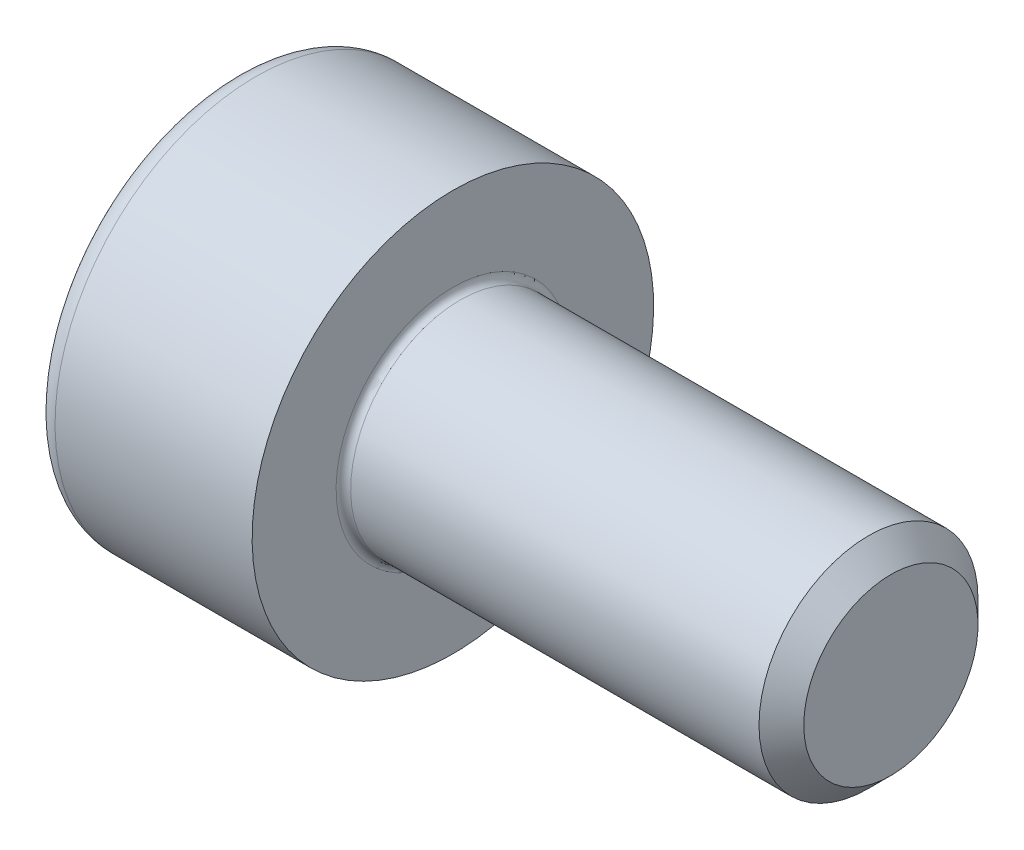
ISO-10303-21;
HEADER;
FILE_DESCRIPTION(('STEP AP214'),'2;1');
FILE_NAME('part.step','',(''),(''),'','','');
FILE_SCHEMA(('AUTOMOTIVE_DESIGN { 1 0 10303 214 1 1 1 1 }'));
ENDSEC;
DATA;
#1=APPLICATION_CONTEXT('core data for automotive mechanical design processes');
#2=APPLICATION_PROTOCOL_DEFINITION('international standard','automotive_design',2000,#1);
#3=PRODUCT_CONTEXT('',#1,'mechanical');
#4=PRODUCT('Part','Part','',(#3));
#5=PRODUCT_RELATED_PRODUCT_CATEGORY('part','',(#4));
#6=PRODUCT_DEFINITION_FORMATION('','',#4);
#7=PRODUCT_DEFINITION_CONTEXT('part definition',#1,'design');
#8=PRODUCT_DEFINITION('design','',#6,#7);
#9=PRODUCT_DEFINITION_SHAPE('','',#8);
#10=(LENGTH_UNIT() NAMED_UNIT(*) SI_UNIT(.MILLI.,.METRE.));
#11=(NAMED_UNIT(*) PLANE_ANGLE_UNIT() SI_UNIT($,.RADIAN.));
#12=(NAMED_UNIT(*) SI_UNIT($,.STERADIAN.) SOLID_ANGLE_UNIT());
#13=UNCERTAINTY_MEASURE_WITH_UNIT(LENGTH_MEASURE(1.E-05),#10,'distance_accuracy_value','');
#14=(GEOMETRIC_REPRESENTATION_CONTEXT(3) GLOBAL_UNCERTAINTY_ASSIGNED_CONTEXT((#13)) GLOBAL_UNIT_ASSIGNED_CONTEXT((#10,
#11,#12)) REPRESENTATION_CONTEXT('',''));
#15=CARTESIAN_POINT('',(0.,0.,0.));
#16=DIRECTION('',(0.,0.,1.));
#17=DIRECTION('',(1.,0.,0.));
#18=AXIS2_PLACEMENT_3D('',#15,#16,#17);
#19=CARTESIAN_POINT('',(-1.50499999995191,0.,0.));
#20=DIRECTION('',(-1.,0.,0.));
#21=DIRECTION('',(0.,0.,1.));
#22=AXIS2_PLACEMENT_3D('',#19,#20,#21);
#23=CONICAL_SURFACE('',#22,1.45203592694543,1.04719755110347);
#24=CARTESIAN_POINT('',(-0.666666666631954,-5.6843418860808E-11,0.));
#25=VERTEX_POINT('',#24);
#26=VERTEX_LOOP('',#25);
#27=FACE_BOUND('',#26,.T.);
#28=CARTESIAN_POINT('',(-1.49999999999004,1.25,0.721687836489904));
#29=CARTESIAN_POINT('',(-1.48168471568985,1.25,0.658260217059864));
#30=CARTESIAN_POINT('',(-1.46502792316932,1.25,0.594285091321007));
#31=CARTESIAN_POINT('',(-1.43595399209987,1.25,0.465227153334786));
#32=CARTESIAN_POINT('',(-1.42354713768306,1.25,0.40014204872408));
#33=CARTESIAN_POINT('',(-1.40423497430876,1.25,0.270778406577995));
#34=CARTESIAN_POINT('',(-1.3972011172141,1.25,0.206519767721449));
#35=CARTESIAN_POINT('',(-1.38880573004626,1.25,0.0777002896277506));
#36=CARTESIAN_POINT('',(-1.38743724619873,1.25,0.0131399182931016));
#37=CARTESIAN_POINT('',(-1.39029143131319,1.25,-0.107484209673351));
#38=CARTESIAN_POINT('',(-1.39381330322771,1.25,-0.163566066938274));
#39=CARTESIAN_POINT('',(-1.40497331291925,1.25,-0.275364426461426));
#40=CARTESIAN_POINT('',(-1.41261525920259,1.25,-0.331080542327595));
#41=CARTESIAN_POINT('',(-1.4317186458128,1.25,-0.443109217014839));
#42=CARTESIAN_POINT('',(-1.44326102636524,1.25,-0.49940760424794));
#43=CARTESIAN_POINT('',(-1.46945735050873,1.25,-0.611164931126897));
#44=CARTESIAN_POINT('',(-1.48410514295715,1.25,-0.666625301408834));
#45=CARTESIAN_POINT('',(-1.49999999999004,1.25,-0.721687836489906));
#46=B_SPLINE_CURVE_WITH_KNOTS('',3,(#28,#29,#30,#31,#32,#33,#34,#35,#36,#37,#38,#39,#40,#41,#42,
#43,#44,#45),.UNSPECIFIED.,.F.,.F.,(4,2,2,2,2,2,2,2,4),(0.,0.198135007230315,0.396746135656778,
0.590442253865621,0.783900555586254,0.952317364166839,1.12089012114027,1.2932010140725,
1.46517373346208),.UNSPECIFIED.);
#47=CARTESIAN_POINT('',(-1.49999999999004,1.25000000000124,0.721687836487751));
#48=VERTEX_POINT('',#47);
#49=CARTESIAN_POINT('',(-1.49999999998963,1.25,-0.721687836488469));
#50=VERTEX_POINT('',#49);
#51=EDGE_CURVE('E20',#48,#50,#46,.T.);
#52=ORIENTED_EDGE('',*,*,#51,.T.);
#53=CARTESIAN_POINT('',(-1.49999999999004,1.25000000000249,-0.721687836485598));
#54=CARTESIAN_POINT('',(-1.48168471568985,1.1950700702745,-0.753401646200618));
#55=CARTESIAN_POINT('',(-1.46502792316932,1.13966598617435,-0.785389209070046));
#56=CARTESIAN_POINT('',(-1.43595399209987,1.02789853331824,-0.849918178063157));
#57=CARTESIAN_POINT('',(-1.42354713768306,0.971533179317402,-0.88246073036851));
#58=CARTESIAN_POINT('',(-1.40423497430876,0.859500978892814,-0.947142551441552));
#59=CARTESIAN_POINT('',(-1.3972011172141,0.803851365230434,-0.979271870869826));
#60=CARTESIAN_POINT('',(-1.38880573004627,0.692290424699039,-1.04368160991667));
#61=CARTESIAN_POINT('',(-1.38743724619873,0.636379503045476,-1.075961795584));
#62=CARTESIAN_POINT('',(-1.3902914313132,0.531915943917184,-1.13627385956723));
#63=CARTESIAN_POINT('',(-1.39381330322771,0.483347630834348,-1.16431478819969));
#64=CARTESIAN_POINT('',(-1.40497331291925,0.386527411385872,-1.22021396796126));
#65=CARTESIAN_POINT('',(-1.41261525920259,0.338275839645572,-1.24807202589435));
#66=CARTESIAN_POINT('',(-1.4317186458128,0.241256161414116,-1.30408636323797));
#67=CARTESIAN_POINT('',(-1.44326102636524,0.192500327878158,-1.33223555685452));
#68=CARTESIAN_POINT('',(-1.46945735050873,0.0957156437419392,-1.388114220294));
#69=CARTESIAN_POINT('',(-1.48410514295715,0.0476855541744902,-1.41584440543497));
#70=CARTESIAN_POINT('',(-1.49999999999004,-2.48950866463537E-12,-1.4433756729755));
#71=B_SPLINE_CURVE_WITH_KNOTS('',3,(#53,#54,#55,#56,#57,#58,#59,#60,#61,#62,#63,#64,#65,#66,#67,
#68,#69,#70),.UNSPECIFIED.,.F.,.F.,(4,2,2,2,2,2,2,2,4),(0.,0.198135007230316,0.396746135656778,
0.590442253865621,0.783900555586254,0.952317364166839,1.12089012114027,1.2932010140725,
1.46517373346208),.UNSPECIFIED.);
#72=CARTESIAN_POINT('',(-1.49999999999004,0.,-1.4433756729755));
#73=VERTEX_POINT('',#72);
#74=EDGE_CURVE('E81',#50,#73,#71,.T.);
#75=ORIENTED_EDGE('',*,*,#74,.T.);
#76=CARTESIAN_POINT('',(-1.49999999999004,2.48350391731348E-12,-1.4433756729755));
#77=CARTESIAN_POINT('',(-1.48168471568985,-0.0549299297255024,-1.41166186326048));
#78=CARTESIAN_POINT('',(-1.46502792316932,-0.110334013825656,-1.37967430039106));
#79=CARTESIAN_POINT('',(-1.43595399209988,-0.222101466681762,-1.31514533139794));
#80=CARTESIAN_POINT('',(-1.42354713768306,-0.2784668206826,-1.28260277909259));
#81=CARTESIAN_POINT('',(-1.40423497430876,-0.390499021107189,-1.21792095801955));
#82=CARTESIAN_POINT('',(-1.39720111721411,-0.446148634769569,-1.18579163859128));
#83=CARTESIAN_POINT('',(-1.38880573004627,-0.557709575300964,-1.12138189954443));
#84=CARTESIAN_POINT('',(-1.38743724619873,-0.613620496954527,-1.0891017138771));
#85=CARTESIAN_POINT('',(-1.3902914313132,-0.71808405608282,-1.02878964989388));
#86=CARTESIAN_POINT('',(-1.39381330322771,-0.766652369165656,-1.00074872126142));
#87=CARTESIAN_POINT('',(-1.40497331291926,-0.86347258861413,-0.94484954149984));
#88=CARTESIAN_POINT('',(-1.41261525920259,-0.91172416035443,-0.916991483566755));
#89=CARTESIAN_POINT('',(-1.43171864581281,-1.00874383858588,-0.860977146223133));
#90=CARTESIAN_POINT('',(-1.44326102636524,-1.05749967212184,-0.832827952606583));
#91=CARTESIAN_POINT('',(-1.46945735050874,-1.15428435625806,-0.776949289167105));
#92=CARTESIAN_POINT('',(-1.48410514295715,-1.20231444582551,-0.749219104026137));
#93=CARTESIAN_POINT('',(-1.49999999999005,-1.25000000000249,-0.721687836485601));
#94=B_SPLINE_CURVE_WITH_KNOTS('',3,(#76,#77,#78,#79,#80,#81,#82,#83,#84,#85,#86,#87,#88,#89,#90,
#91,#92,#93),.UNSPECIFIED.,.F.,.F.,(4,2,2,2,2,2,2,2,4),(0.,0.198135007230316,0.396746135656779,
0.590442253865623,0.783900555586256,0.95231736416684,1.12089012114027,1.2932010140725,
1.46517373346208),.UNSPECIFIED.);
#95=CARTESIAN_POINT('',(-1.49999999999004,-1.25000000000124,-0.721687836487754));
#96=VERTEX_POINT('',#95);
#97=EDGE_CURVE('E112',#73,#96,#94,.T.);
#98=ORIENTED_EDGE('',*,*,#97,.T.);
#99=CARTESIAN_POINT('',(-1.49999999999004,-1.25,-0.721687836489906));
#100=CARTESIAN_POINT('',(-1.48168471568985,-1.25,-0.658260217059866));
#101=CARTESIAN_POINT('',(-1.46502792316932,-1.25,-0.594285091321009));
#102=CARTESIAN_POINT('',(-1.43595399209987,-1.25,-0.465227153334788));
#103=CARTESIAN_POINT('',(-1.42354713768306,-1.25,-0.400142048724082));
#104=CARTESIAN_POINT('',(-1.40423497430876,-1.25,-0.270778406577997));
#105=CARTESIAN_POINT('',(-1.3972011172141,-1.25,-0.206519767721451));
#106=CARTESIAN_POINT('',(-1.38880573004627,-1.25,-0.0777002896277524));
#107=CARTESIAN_POINT('',(-1.38743724619873,-1.25,-0.0131399182931034));
#108=CARTESIAN_POINT('',(-1.39029143131319,-1.25,0.107484209673349));
#109=CARTESIAN_POINT('',(-1.39381330322771,-1.25,0.163566066938272));
#110=CARTESIAN_POINT('',(-1.40497331291925,-1.25,0.275364426461424));
#111=CARTESIAN_POINT('',(-1.41261525920259,-1.25,0.331080542327594));
#112=CARTESIAN_POINT('',(-1.4317186458128,-1.25,0.443109217014838));
#113=CARTESIAN_POINT('',(-1.44326102636524,-1.25,0.499407604247938));
#114=CARTESIAN_POINT('',(-1.46945735050873,-1.25,0.611164931126896));
#115=CARTESIAN_POINT('',(-1.48410514295715,-1.25,0.666625301408833));
#116=CARTESIAN_POINT('',(-1.49999999999004,-1.25,0.721687836489905));
#117=B_SPLINE_CURVE_WITH_KNOTS('',3,(#99,#100,#101,#102,#103,#104,#105,#106,#107,#108,#109,#110,
#111,#112,#113,#114,#115,#116),.UNSPECIFIED.,.F.,.F.,(4,2,2,2,2,2,2,2,4),(0.,0.198135007230316,
0.396746135656778,0.590442253865622,0.783900555586254,0.95231736416684,1.12089012114027,
1.2932010140725,1.46517373346208),.UNSPECIFIED.);
#118=CARTESIAN_POINT('',(-1.49999999999004,-1.25000000000124,0.721687836487751));
#119=VERTEX_POINT('',#118);
#120=EDGE_CURVE('E136',#96,#119,#117,.T.);
#121=ORIENTED_EDGE('',*,*,#120,.T.);
#122=CARTESIAN_POINT('',(-1.49999999999004,-1.25000000000249,0.721687836485597));
#123=CARTESIAN_POINT('',(-1.48168471568985,-1.1950700702745,0.753401646200617));
#124=CARTESIAN_POINT('',(-1.46502792316932,-1.13966598617435,0.785389209070046));
#125=CARTESIAN_POINT('',(-1.43595399209987,-1.02789853331824,0.849918178063156));
#126=CARTESIAN_POINT('',(-1.42354713768306,-0.971533179317404,0.882460730368509));
#127=CARTESIAN_POINT('',(-1.40423497430876,-0.859500978892815,0.947142551441551));
#128=CARTESIAN_POINT('',(-1.3972011172141,-0.803851365230436,0.979271870869825));
#129=CARTESIAN_POINT('',(-1.38880573004627,-0.69229042469904,1.04368160991667));
#130=CARTESIAN_POINT('',(-1.38743724619873,-0.636379503045478,1.075961795584));
#131=CARTESIAN_POINT('',(-1.39029143131319,-0.531915943917185,1.13627385956722));
#132=CARTESIAN_POINT('',(-1.39381330322771,-0.483347630834349,1.16431478819969));
#133=CARTESIAN_POINT('',(-1.40497331291925,-0.386527411385873,1.22021396796126));
#134=CARTESIAN_POINT('',(-1.41261525920259,-0.338275839645574,1.24807202589435));
#135=CARTESIAN_POINT('',(-1.4317186458128,-0.241256161414118,1.30408636323797));
#136=CARTESIAN_POINT('',(-1.44326102636524,-0.192500327878159,1.33223555685452));
#137=CARTESIAN_POINT('',(-1.46945735050873,-0.0957156437419403,1.388114220294));
#138=CARTESIAN_POINT('',(-1.48410514295715,-0.0476855541744914,1.41584440543497));
#139=CARTESIAN_POINT('',(-1.49999999999004,2.48814392209341E-12,1.4433756729755));
#140=B_SPLINE_CURVE_WITH_KNOTS('',3,(#122,#123,#124,#125,#126,#127,#128,#129,#130,#131,#132,
#133,#134,#135,#136,#137,#138,#139),.UNSPECIFIED.,.F.,.F.,(4,2,2,2,2,2,2,2,4),(0.,
0.198135007230316,0.396746135656778,0.590442253865622,0.783900555586254,0.95231736416684,
1.12089012114027,1.2932010140725,1.46517373346208),.UNSPECIFIED.);
#141=CARTESIAN_POINT('',(-1.49999999999004,0.,1.4433756729755));
#142=VERTEX_POINT('',#141);
#143=EDGE_CURVE('E145',#119,#142,#140,.T.);
#144=ORIENTED_EDGE('',*,*,#143,.T.);
#145=CARTESIAN_POINT('',(-1.49999999999005,-2.48476584893157E-12,1.4433756729755));
#146=CARTESIAN_POINT('',(-1.48168471568985,0.0549299297255009,1.41166186326048));
#147=CARTESIAN_POINT('',(-1.46502792316932,0.110334013825655,1.37967430039106));
#148=CARTESIAN_POINT('',(-1.43595399209988,0.22210146668176,1.31514533139794));
#149=CARTESIAN_POINT('',(-1.42354713768306,0.278466820682599,1.28260277909259));
#150=CARTESIAN_POINT('',(-1.40423497430876,0.390499021107188,1.21792095801955));
#151=CARTESIAN_POINT('',(-1.39720111721411,0.446148634769567,1.18579163859128));
#152=CARTESIAN_POINT('',(-1.38880573004627,0.557709575300963,1.12138189954443));
#153=CARTESIAN_POINT('',(-1.38743724619873,0.613620496954526,1.0891017138771));
#154=CARTESIAN_POINT('',(-1.3902914313132,0.718084056082818,1.02878964989388));
#155=CARTESIAN_POINT('',(-1.39381330322771,0.766652369165654,1.00074872126141));
#156=CARTESIAN_POINT('',(-1.40497331291926,0.863472588614129,0.944849541499838));
#157=CARTESIAN_POINT('',(-1.41261525920259,0.911724160354429,0.916991483566754));
#158=CARTESIAN_POINT('',(-1.4317186458128,1.00874383858588,0.860977146223132));
#159=CARTESIAN_POINT('',(-1.44326102636524,1.05749967212184,0.832827952606581));
#160=CARTESIAN_POINT('',(-1.46945735050874,1.15428435625806,0.776949289167103));
#161=CARTESIAN_POINT('',(-1.48410514295715,1.20231444582551,0.749219104026134));
#162=CARTESIAN_POINT('',(-1.49999999999004,1.25000000000249,0.721687836485599));
#163=B_SPLINE_CURVE_WITH_KNOTS('',3,(#145,#146,#147,#148,#149,#150,#151,#152,#153,#154,#155,
#156,#157,#158,#159,#160,#161,#162),.UNSPECIFIED.,.F.,.F.,(4,2,2,2,2,2,2,2,4),(0.,
0.198135007230316,0.396746135656779,0.590442253865623,0.783900555586256,0.952317364166841,
1.12089012114027,1.2932010140725,1.46517373346208),.UNSPECIFIED.);
#164=EDGE_CURVE('E83',#142,#48,#163,.T.);
#165=ORIENTED_EDGE('',*,*,#164,.T.);
#166=EDGE_LOOP('',(#52,#75,#98,#121,#144,#165));
#167=FACE_BOUND('',#166,.T.);
#168=ADVANCED_FACE('F16',(#27,#167),#23,.F.);
#169=CARTESIAN_POINT('',(-2.99999999999999,1.25,0.721687836487031));
#170=DIRECTION('',(0.,1.,0.));
#171=DIRECTION('',(0.,0.,1.));
#172=AXIS2_PLACEMENT_3D('',#169,#170,#171);
#173=PLANE('',#172);
#174=DIRECTION('',(1.,0.,0.));
#175=VECTOR('',#174,1.);
#176=CARTESIAN_POINT('',(-2.99999999999999,1.25,0.721687836487034));
#177=LINE('',#176,#175);
#178=CARTESIAN_POINT('',(-2.99999999999999,1.25,0.721687836487032));
#179=VERTEX_POINT('',#178);
#180=EDGE_CURVE('E86',#48,#179,#177,.F.);
#181=ORIENTED_EDGE('',*,*,#180,.T.);
#182=DIRECTION('',(0.,0.,1.));
#183=VECTOR('',#182,1.);
#184=CARTESIAN_POINT('',(-2.99999999999999,1.25,0.));
#185=LINE('',#184,#183);
#186=CARTESIAN_POINT('',(-2.99999999999999,1.25,-0.721687836487033));
#187=VERTEX_POINT('',#186);
#188=EDGE_CURVE('E91',#187,#179,#185,.T.);
#189=ORIENTED_EDGE('',*,*,#188,.F.);
#190=DIRECTION('',(1.,0.,0.));
#191=VECTOR('',#190,1.);
#192=CARTESIAN_POINT('',(-2.99999999999999,1.25,-0.721687836487033));
#193=LINE('',#192,#191);
#194=EDGE_CURVE('E89',#187,#50,#193,.T.);
#195=ORIENTED_EDGE('',*,*,#194,.T.);
#196=ORIENTED_EDGE('',*,*,#51,.F.);
#197=EDGE_LOOP('',(#181,#189,#195,#196));
#198=FACE_BOUND('',#197,.T.);
#199=ADVANCED_FACE('F77',(#198),#173,.F.);
#200=CARTESIAN_POINT('',(-2.99999999999999,0.,1.44337567297407));
#201=DIRECTION('',(0.,0.500000000000001,0.866025403784438));
#202=DIRECTION('',(0.,-0.866025403784438,0.500000000000001));
#203=AXIS2_PLACEMENT_3D('',#200,#201,#202);
#204=PLANE('',#203);
#205=DIRECTION('',(1.,0.,0.));
#206=VECTOR('',#205,1.);
#207=CARTESIAN_POINT('',(-2.99999999999999,0.,1.44337567297407));
#208=LINE('',#207,#206);
#209=CARTESIAN_POINT('',(-2.99999999999999,0.,1.44337567297407));
#210=VERTEX_POINT('',#209);
#211=EDGE_CURVE('E150',#142,#210,#208,.F.);
#212=ORIENTED_EDGE('',*,*,#211,.T.);
#213=DIRECTION('',(0.,-0.866025403784437,0.500000000000004));
#214=VECTOR('',#213,1.);
#215=CARTESIAN_POINT('',(-2.99999999999999,1.25,0.721687836487031));
#216=LINE('',#215,#214);
#217=EDGE_CURVE('E102',#179,#210,#216,.T.);
#218=ORIENTED_EDGE('',*,*,#217,.F.);
#219=ORIENTED_EDGE('',*,*,#180,.F.);
#220=ORIENTED_EDGE('',*,*,#164,.F.);
#221=EDGE_LOOP('',(#212,#218,#219,#220));
#222=FACE_BOUND('',#221,.T.);
#223=ADVANCED_FACE('F155',(#222),#204,.F.);
#224=CARTESIAN_POINT('',(-2.99999999999999,-1.25,0.721687836487033));
#225=DIRECTION('',(0.,-0.5,0.866025403784439));
#226=DIRECTION('',(0.,-0.866025403784439,-0.5));
#227=AXIS2_PLACEMENT_3D('',#224,#225,#226);
#228=PLANE('',#227);
#229=DIRECTION('',(1.,0.,0.));
#230=VECTOR('',#229,1.);
#231=CARTESIAN_POINT('',(-2.99999999999999,-1.25,0.721687836487033));
#232=LINE('',#231,#230);
#233=CARTESIAN_POINT('',(-2.99999999999999,-1.25,0.721687836487033));
#234=VERTEX_POINT('',#233);
#235=EDGE_CURVE('E144',#119,#234,#232,.F.);
#236=ORIENTED_EDGE('',*,*,#235,.T.);
#237=DIRECTION('',(0.,-0.866025403784437,-0.500000000000003));
#238=VECTOR('',#237,1.);
#239=CARTESIAN_POINT('',(-2.99999999999999,0.,1.44337567297407));
#240=LINE('',#239,#238);
#241=EDGE_CURVE('E282',#210,#234,#240,.T.);
#242=ORIENTED_EDGE('',*,*,#241,.F.);
#243=ORIENTED_EDGE('',*,*,#211,.F.);
#244=ORIENTED_EDGE('',*,*,#143,.F.);
#245=EDGE_LOOP('',(#236,#242,#243,#244));
#246=FACE_BOUND('',#245,.T.);
#247=ADVANCED_FACE('F132',(#246),#228,.F.);
#248=CARTESIAN_POINT('',(-2.99999999999999,-1.25,-0.721687836487032));
#249=DIRECTION('',(0.,-1.,0.));
#250=DIRECTION('',(1.,0.,0.));
#251=AXIS2_PLACEMENT_3D('',#248,#249,#250);
#252=PLANE('',#251);
#253=DIRECTION('',(1.,0.,0.));
#254=VECTOR('',#253,1.);
#255=CARTESIAN_POINT('',(-2.99999999999999,-1.25,-0.721687836487037));
#256=LINE('',#255,#254);
#257=CARTESIAN_POINT('',(-2.99999999999999,-1.25,-0.721687836487034));
#258=VERTEX_POINT('',#257);
#259=EDGE_CURVE('E143',#96,#258,#256,.F.);
#260=ORIENTED_EDGE('',*,*,#259,.T.);
#261=DIRECTION('',(0.,0.,1.));
#262=VECTOR('',#261,1.);
#263=CARTESIAN_POINT('',(-2.99999999999999,-1.25,0.));
#264=LINE('',#263,#262);
#265=EDGE_CURVE('E276',#234,#258,#264,.F.);
#266=ORIENTED_EDGE('',*,*,#265,.F.);
#267=ORIENTED_EDGE('',*,*,#235,.F.);
#268=ORIENTED_EDGE('',*,*,#120,.F.);
#269=EDGE_LOOP('',(#260,#266,#267,#268));
#270=FACE_BOUND('',#269,.T.);
#271=ADVANCED_FACE('F128',(#270),#252,.F.);
#272=CARTESIAN_POINT('',(-2.99999999999999,0.,-1.44337567297407));
#273=DIRECTION('',(0.,-0.5,-0.866025403784439));
#274=DIRECTION('',(0.,0.866025403784439,-0.5));
#275=AXIS2_PLACEMENT_3D('',#272,#273,#274);
#276=PLANE('',#275);
#277=DIRECTION('',(1.,0.,0.));
#278=VECTOR('',#277,1.);
#279=CARTESIAN_POINT('',(-2.99999999999999,0.,-1.44337567297407));
#280=LINE('',#279,#278);
#281=CARTESIAN_POINT('',(-2.99999999999999,0.,-1.44337567297407));
#282=VERTEX_POINT('',#281);
#283=EDGE_CURVE('E39',#73,#282,#280,.F.);
#284=ORIENTED_EDGE('',*,*,#283,.T.);
#285=DIRECTION('',(0.,0.866025403784437,-0.500000000000003));
#286=VECTOR('',#285,1.);
#287=CARTESIAN_POINT('',(-2.99999999999999,-1.25,-0.721687836487032));
#288=LINE('',#287,#286);
#289=EDGE_CURVE('E270',#258,#282,#288,.T.);
#290=ORIENTED_EDGE('',*,*,#289,.F.);
#291=ORIENTED_EDGE('',*,*,#259,.F.);
#292=ORIENTED_EDGE('',*,*,#97,.F.);
#293=EDGE_LOOP('',(#284,#290,#291,#292));
#294=FACE_BOUND('',#293,.T.);
#295=ADVANCED_FACE('F122',(#294),#276,.F.);
#296=CARTESIAN_POINT('',(-2.99999999999999,1.25,-0.721687836487033));
#297=DIRECTION('',(0.,0.5,-0.866025403784439));
#298=DIRECTION('',(0.,0.866025403784439,0.5));
#299=AXIS2_PLACEMENT_3D('',#296,#297,#298);
#300=PLANE('',#299);
#301=ORIENTED_EDGE('',*,*,#194,.F.);
#302=DIRECTION('',(0.,0.866025403784437,0.500000000000002));
#303=VECTOR('',#302,1.);
#304=CARTESIAN_POINT('',(-2.99999999999999,0.,-1.44337567297407));
#305=LINE('',#304,#303);
#306=EDGE_CURVE('E267',#282,#187,#305,.T.);
#307=ORIENTED_EDGE('',*,*,#306,.F.);
#308=ORIENTED_EDGE('',*,*,#283,.F.);
#309=ORIENTED_EDGE('',*,*,#74,.F.);
#310=EDGE_LOOP('',(#301,#307,#308,#309));
#311=FACE_BOUND('',#310,.T.);
#312=ADVANCED_FACE('F96',(#311),#300,.F.);
#313=CARTESIAN_POINT('',(-2.99999999999999,2.09668783648703,0.));
#314=DIRECTION('',(-1.,0.,0.));
#315=DIRECTION('',(0.,-1.,0.));
#316=AXIS2_PLACEMENT_3D('',#313,#314,#315);
#317=PLANE('',#316);
#318=ORIENTED_EDGE('',*,*,#289,.T.);
#319=ORIENTED_EDGE('',*,*,#306,.T.);
#320=ORIENTED_EDGE('',*,*,#188,.T.);
#321=ORIENTED_EDGE('',*,*,#217,.T.);
#322=ORIENTED_EDGE('',*,*,#241,.T.);
#323=ORIENTED_EDGE('',*,*,#265,.T.);
#324=EDGE_LOOP('',(#318,#319,#320,#321,#322,#323));
#325=FACE_BOUND('',#324,.T.);
#326=CARTESIAN_POINT('',(-2.99999999999999,0.,0.));
#327=DIRECTION('',(1.,0.,0.));
#328=DIRECTION('',(0.,1.,0.));
#329=AXIS2_PLACEMENT_3D('',#326,#327,#328);
#330=CIRCLE('',#329,2.45);
#331=CARTESIAN_POINT('',(-2.99999999999999,2.45,0.));
#332=VERTEX_POINT('',#331);
#333=EDGE_CURVE('E225',#332,#332,#330,.T.);
#334=ORIENTED_EDGE('',*,*,#333,.F.);
#335=EDGE_LOOP('',(#334));
#336=FACE_BOUND('',#335,.T.);
#337=ADVANCED_FACE('F121',(#325,#336),#317,.T.);
#338=CARTESIAN_POINT('',(-2.69999999999999,0.,0.));
#339=DIRECTION('',(1.,0.,0.));
#340=DIRECTION('',(0.,0.,-1.));
#341=AXIS2_PLACEMENT_3D('',#338,#339,#340);
#342=TOROIDAL_SURFACE('',#341,2.45,0.3);
#343=CARTESIAN_POINT('',(-2.69999999999999,0.,0.));
#344=DIRECTION('',(1.,0.,0.));
#345=DIRECTION('',(0.,1.,0.));
#346=AXIS2_PLACEMENT_3D('',#343,#344,#345);
#347=CIRCLE('',#346,2.75);
#348=CARTESIAN_POINT('',(-2.69999999999999,2.75,0.));
#349=VERTEX_POINT('',#348);
#350=EDGE_CURVE('E303',#349,#349,#347,.T.);
#351=ORIENTED_EDGE('',*,*,#350,.F.);
#352=EDGE_LOOP('',(#351));
#353=FACE_BOUND('',#352,.T.);
#354=ORIENTED_EDGE('',*,*,#333,.T.);
#355=EDGE_LOOP('',(#354));
#356=FACE_BOUND('',#355,.T.);
#357=ADVANCED_FACE('F209',(#353,#356),#342,.T.);
#358=CARTESIAN_POINT('',(-1.5,0.,0.));
#359=DIRECTION('',(1.,0.,0.));
#360=DIRECTION('',(0.,1.,0.));
#361=AXIS2_PLACEMENT_3D('',#358,#359,#360);
#362=CYLINDRICAL_SURFACE('',#361,2.75);
#363=ORIENTED_EDGE('',*,*,#350,.T.);
#364=EDGE_LOOP('',(#363));
#365=FACE_BOUND('',#364,.T.);
#366=CARTESIAN_POINT('',(0.,0.,0.));
#367=DIRECTION('',(1.,0.,0.));
#368=DIRECTION('',(0.,1.,0.));
#369=AXIS2_PLACEMENT_3D('',#366,#367,#368);
#370=CIRCLE('',#369,2.75);
#371=CARTESIAN_POINT('',(0.,2.75,0.));
#372=VERTEX_POINT('',#371);
#373=EDGE_CURVE('E110',#372,#372,#370,.T.);
#374=ORIENTED_EDGE('',*,*,#373,.F.);
#375=EDGE_LOOP('',(#374));
#376=FACE_BOUND('',#375,.T.);
#377=ADVANCED_FACE('F206',(#365,#376),#362,.T.);
#378=CARTESIAN_POINT('',(6.00000000000001,0.749999999999999,0.));
#379=DIRECTION('',(1.,0.,0.));
#380=DIRECTION('',(0.,1.,0.));
#381=AXIS2_PLACEMENT_3D('',#378,#379,#380);
#382=PLANE('',#381);
#383=CARTESIAN_POINT('',(5.99999999997181,0.,0.));
#384=DIRECTION('',(-1.,0.,0.));
#385=DIRECTION('',(0.,0.,1.));
#386=AXIS2_PLACEMENT_3D('',#383,#384,#385);
#387=CIRCLE('',#386,1.19327500004829);
#388=CARTESIAN_POINT('',(5.99999999997181,0.,1.19327500004829));
#389=VERTEX_POINT('',#388);
#390=EDGE_CURVE('E294',#389,#389,#387,.T.);
#391=ORIENTED_EDGE('',*,*,#390,.F.);
#392=EDGE_LOOP('',(#391));
#393=FACE_BOUND('',#392,.T.);
#394=ADVANCED_FACE('F203',(#393),#382,.T.);
#395=CARTESIAN_POINT('',(0.,2.125,0.));
#396=DIRECTION('',(1.,0.,0.));
#397=DIRECTION('',(0.,1.,0.));
#398=AXIS2_PLACEMENT_3D('',#395,#396,#397);
#399=PLANE('',#398);
#400=CARTESIAN_POINT('',(0.,0.,0.));
#401=DIRECTION('',(1.,0.,0.));
#402=DIRECTION('',(0.,1.,0.));
#403=AXIS2_PLACEMENT_3D('',#400,#401,#402);
#404=CIRCLE('',#403,1.6);
#405=CARTESIAN_POINT('',(0.,1.6,0.));
#406=VERTEX_POINT('',#405);
#407=EDGE_CURVE('E190',#406,#406,#404,.F.);
#408=ORIENTED_EDGE('',*,*,#407,.T.);
#409=EDGE_LOOP('',(#408));
#410=FACE_BOUND('',#409,.T.);
#411=ORIENTED_EDGE('',*,*,#373,.T.);
#412=EDGE_LOOP('',(#411));
#413=FACE_BOUND('',#412,.T.);
#414=ADVANCED_FACE('F194',(#410,#413),#399,.T.);
#415=CARTESIAN_POINT('',(5.69327499999872,0.,0.));
#416=DIRECTION('',(-1.,0.,0.));
#417=DIRECTION('',(0.,0.,1.));
#418=AXIS2_PLACEMENT_3D('',#415,#416,#417);
#419=CONICAL_SURFACE('',#418,1.50000000002137,0.785398163397448);
#420=ORIENTED_EDGE('',*,*,#390,.T.);
#421=EDGE_LOOP('',(#420));
#422=FACE_BOUND('',#421,.T.);
#423=CARTESIAN_POINT('',(5.69327500000001,0.,0.));
#424=DIRECTION('',(1.,0.,0.));
#425=DIRECTION('',(0.,1.,0.));
#426=AXIS2_PLACEMENT_3D('',#423,#424,#425);
#427=CIRCLE('',#426,1.5);
#428=CARTESIAN_POINT('',(5.69327500000001,1.5,0.));
#429=VERTEX_POINT('',#428);
#430=EDGE_CURVE('E30',#429,#429,#427,.F.);
#431=ORIENTED_EDGE('',*,*,#430,.F.);
#432=EDGE_LOOP('',(#431));
#433=FACE_BOUND('',#432,.T.);
#434=ADVANCED_FACE('F172',(#422,#433),#419,.T.);
#435=CARTESIAN_POINT('',(0.100000000000002,0.,0.));
#436=DIRECTION('',(1.,0.,0.));
#437=DIRECTION('',(0.,0.,-1.));
#438=AXIS2_PLACEMENT_3D('',#435,#436,#437);
#439=TOROIDAL_SURFACE('',#438,1.6,0.1);
#440=CARTESIAN_POINT('',(0.100000000000002,0.,0.));
#441=DIRECTION('',(1.,0.,0.));
#442=DIRECTION('',(0.,1.,0.));
#443=AXIS2_PLACEMENT_3D('',#440,#441,#442);
#444=CIRCLE('',#443,1.5);
#445=CARTESIAN_POINT('',(0.100000000000002,1.5,0.));
#446=VERTEX_POINT('',#445);
#447=EDGE_CURVE('E11',#446,#446,#444,.T.);
#448=ORIENTED_EDGE('',*,*,#447,.F.);
#449=EDGE_LOOP('',(#448));
#450=FACE_BOUND('',#449,.T.);
#451=ORIENTED_EDGE('',*,*,#407,.F.);
#452=EDGE_LOOP('',(#451));
#453=FACE_BOUND('',#452,.T.);
#454=ADVANCED_FACE('F166',(#450,#453),#439,.F.);
#455=CARTESIAN_POINT('',(3.6533625,0.,0.));
#456=DIRECTION('',(1.,0.,0.));
#457=DIRECTION('',(0.,1.,0.));
#458=AXIS2_PLACEMENT_3D('',#455,#456,#457);
#459=CYLINDRICAL_SURFACE('',#458,1.5);
#460=ORIENTED_EDGE('',*,*,#447,.T.);
#461=EDGE_LOOP('',(#460));
#462=FACE_BOUND('',#461,.T.);
#463=ORIENTED_EDGE('',*,*,#430,.T.);
#464=EDGE_LOOP('',(#463));
#465=FACE_BOUND('',#464,.T.);
#466=ADVANCED_FACE('F164',(#462,#465),#459,.T.);
#467=CLOSED_SHELL('',(#168,#199,#223,#247,#271,#295,#312,#337,#357,#377,#394,#414,#434,#454,#466));
#468=MANIFOLD_SOLID_BREP('B1',#467);
#469=ADVANCED_BREP_SHAPE_REPRESENTATION('',(#18,#468),#14);
#470=SHAPE_DEFINITION_REPRESENTATION(#9,#469);
ENDSEC;
END-ISO-10303-21;
